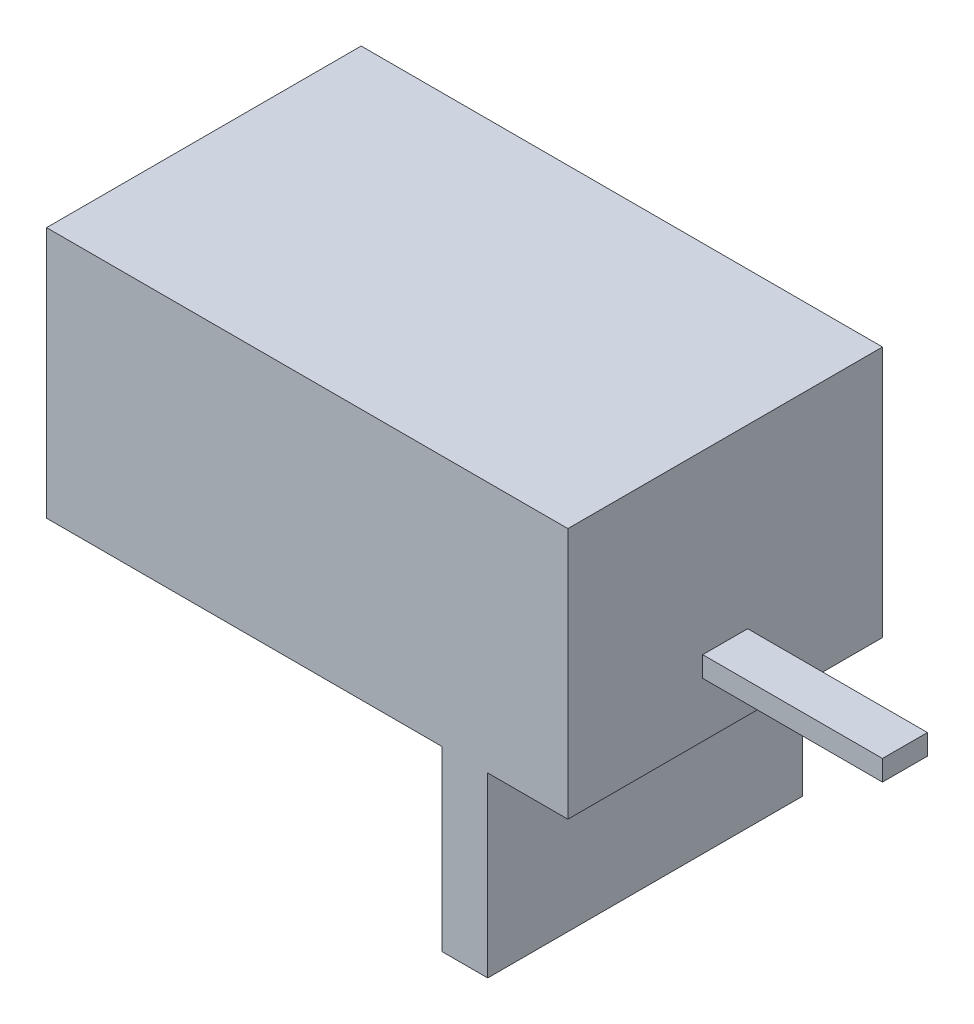
ISO-10303-21;
HEADER;
FILE_DESCRIPTION(('STEP AP214'),'2;1');
FILE_NAME('part.step','',(''),(''),'','','');
FILE_SCHEMA(('AUTOMOTIVE_DESIGN { 1 0 10303 214 1 1 1 1 }'));
ENDSEC;
DATA;
#1=APPLICATION_CONTEXT('core data for automotive mechanical design processes');
#2=APPLICATION_PROTOCOL_DEFINITION('international standard','automotive_design',2000,#1);
#3=PRODUCT_CONTEXT('',#1,'mechanical');
#4=PRODUCT('Part','Part','',(#3));
#5=PRODUCT_RELATED_PRODUCT_CATEGORY('part','',(#4));
#6=PRODUCT_DEFINITION_FORMATION('','',#4);
#7=PRODUCT_DEFINITION_CONTEXT('part definition',#1,'design');
#8=PRODUCT_DEFINITION('design','',#6,#7);
#9=PRODUCT_DEFINITION_SHAPE('','',#8);
#10=(LENGTH_UNIT() NAMED_UNIT(*) SI_UNIT(.MILLI.,.METRE.));
#11=(NAMED_UNIT(*) PLANE_ANGLE_UNIT() SI_UNIT($,.RADIAN.));
#12=(NAMED_UNIT(*) SI_UNIT($,.STERADIAN.) SOLID_ANGLE_UNIT());
#13=UNCERTAINTY_MEASURE_WITH_UNIT(LENGTH_MEASURE(1.E-05),#10,'distance_accuracy_value','');
#14=(GEOMETRIC_REPRESENTATION_CONTEXT(3) GLOBAL_UNCERTAINTY_ASSIGNED_CONTEXT((#13)) GLOBAL_UNIT_ASSIGNED_CONTEXT((#10,
#11,#12)) REPRESENTATION_CONTEXT('',''));
#15=CARTESIAN_POINT('',(0.,0.,0.));
#16=DIRECTION('',(0.,0.,1.));
#17=DIRECTION('',(1.,0.,0.));
#18=AXIS2_PLACEMENT_3D('',#15,#16,#17);
#19=CARTESIAN_POINT('',(0.,0.,0.));
#20=DIRECTION('',(0.,-1.,0.));
#21=DIRECTION('',(0.,0.,-1.));
#22=AXIS2_PLACEMENT_3D('',#19,#20,#21);
#23=PLANE('',#22);
#24=DIRECTION('',(1.,0.,0.));
#25=VECTOR('',#24,1.);
#26=CARTESIAN_POINT('',(-145.,0.,87.5));
#27=LINE('',#26,#25);
#28=CARTESIAN_POINT('',(100.4,0.,87.5));
#29=VERTEX_POINT('',#28);
#30=CARTESIAN_POINT('',(145.,0.,87.5));
#31=VERTEX_POINT('',#30);
#32=EDGE_CURVE('E205',#29,#31,#27,.T.);
#33=ORIENTED_EDGE('',*,*,#32,.F.);
#34=DIRECTION('',(0.,0.,-1.));
#35=VECTOR('',#34,1.);
#36=CARTESIAN_POINT('',(100.4,0.,87.5));
#37=LINE('',#36,#35);
#38=CARTESIAN_POINT('',(100.4,0.,-87.5));
#39=VERTEX_POINT('',#38);
#40=EDGE_CURVE('E165',#29,#39,#37,.T.);
#41=ORIENTED_EDGE('',*,*,#40,.T.);
#42=DIRECTION('',(-1.,0.,0.));
#43=VECTOR('',#42,1.);
#44=CARTESIAN_POINT('',(-145.,0.,-87.5));
#45=LINE('',#44,#43);
#46=CARTESIAN_POINT('',(145.,0.,-87.5));
#47=VERTEX_POINT('',#46);
#48=EDGE_CURVE('E200',#47,#39,#45,.T.);
#49=ORIENTED_EDGE('',*,*,#48,.F.);
#50=DIRECTION('',(0.,0.,-1.));
#51=VECTOR('',#50,1.);
#52=CARTESIAN_POINT('',(145.,0.,87.5));
#53=LINE('',#52,#51);
#54=EDGE_CURVE('E185',#31,#47,#53,.T.);
#55=ORIENTED_EDGE('',*,*,#54,.F.);
#56=EDGE_LOOP('',(#33,#41,#49,#55));
#57=FACE_BOUND('',#56,.T.);
#58=ADVANCED_FACE('F35',(#57),#23,.T.);
#59=CARTESIAN_POINT('',(145.,140.,87.5));
#60=DIRECTION('',(-1.,0.,0.));
#61=DIRECTION('',(0.,0.,1.));
#62=AXIS2_PLACEMENT_3D('',#59,#60,#61);
#63=PLANE('',#62);
#64=DIRECTION('',(0.,0.,-1.));
#65=VECTOR('',#64,1.);
#66=CARTESIAN_POINT('',(145.,41.7642757353534,0.));
#67=LINE('',#66,#65);
#68=CARTESIAN_POINT('',(145.,41.7642757353534,12.5));
#69=VERTEX_POINT('',#68);
#70=CARTESIAN_POINT('',(145.,41.7642757353534,-12.5));
#71=VERTEX_POINT('',#70);
#72=EDGE_CURVE('E50',#69,#71,#67,.T.);
#73=ORIENTED_EDGE('',*,*,#72,.T.);
#74=DIRECTION('',(0.,-1.,0.));
#75=VECTOR('',#74,1.);
#76=CARTESIAN_POINT('',(145.,0.,-12.5));
#77=LINE('',#76,#75);
#78=CARTESIAN_POINT('',(145.,30.3681582866702,-12.5));
#79=VERTEX_POINT('',#78);
#80=EDGE_CURVE('E128',#71,#79,#77,.T.);
#81=ORIENTED_EDGE('',*,*,#80,.T.);
#82=DIRECTION('',(0.,0.,-1.));
#83=VECTOR('',#82,1.);
#84=CARTESIAN_POINT('',(145.,30.3681582866702,0.));
#85=LINE('',#84,#83);
#86=CARTESIAN_POINT('',(145.,30.3681582866702,12.5));
#87=VERTEX_POINT('',#86);
#88=EDGE_CURVE('E141',#87,#79,#85,.T.);
#89=ORIENTED_EDGE('',*,*,#88,.F.);
#90=DIRECTION('',(0.,-1.,0.));
#91=VECTOR('',#90,1.);
#92=CARTESIAN_POINT('',(145.,0.,12.5));
#93=LINE('',#92,#91);
#94=EDGE_CURVE('E55',#69,#87,#93,.T.);
#95=ORIENTED_EDGE('',*,*,#94,.F.);
#96=EDGE_LOOP('',(#73,#81,#89,#95));
#97=FACE_BOUND('',#96,.T.);
#98=ORIENTED_EDGE('',*,*,#54,.T.);
#99=DIRECTION('',(0.,-1.,0.));
#100=VECTOR('',#99,1.);
#101=CARTESIAN_POINT('',(145.,140.,-87.5));
#102=LINE('',#101,#100);
#103=CARTESIAN_POINT('',(145.,140.,-87.5));
#104=VERTEX_POINT('',#103);
#105=EDGE_CURVE('E11',#104,#47,#102,.T.);
#106=ORIENTED_EDGE('',*,*,#105,.F.);
#107=DIRECTION('',(0.,0.,-1.));
#108=VECTOR('',#107,1.);
#109=CARTESIAN_POINT('',(145.,140.,87.5));
#110=LINE('',#109,#108);
#111=CARTESIAN_POINT('',(145.,140.,87.5));
#112=VERTEX_POINT('',#111);
#113=EDGE_CURVE('E186',#112,#104,#110,.T.);
#114=ORIENTED_EDGE('',*,*,#113,.F.);
#115=DIRECTION('',(0.,-1.,0.));
#116=VECTOR('',#115,1.);
#117=CARTESIAN_POINT('',(145.,140.,87.5));
#118=LINE('',#117,#116);
#119=EDGE_CURVE('E196',#112,#31,#118,.T.);
#120=ORIENTED_EDGE('',*,*,#119,.T.);
#121=EDGE_LOOP('',(#98,#106,#114,#120));
#122=FACE_BOUND('',#121,.T.);
#123=ADVANCED_FACE('F37',(#97,#122),#63,.F.);
#124=CARTESIAN_POINT('',(-145.,140.,-87.5));
#125=DIRECTION('',(0.,0.,1.));
#126=DIRECTION('',(1.,0.,0.));
#127=AXIS2_PLACEMENT_3D('',#124,#125,#126);
#128=PLANE('',#127);
#129=ORIENTED_EDGE('',*,*,#48,.T.);
#130=DIRECTION('',(0.,1.,0.));
#131=VECTOR('',#130,1.);
#132=CARTESIAN_POINT('',(100.4,-98.8,-87.5));
#133=LINE('',#132,#131);
#134=CARTESIAN_POINT('',(100.4,-98.8,-87.5));
#135=VERTEX_POINT('',#134);
#136=EDGE_CURVE('E181',#135,#39,#133,.T.);
#137=ORIENTED_EDGE('',*,*,#136,.F.);
#138=DIRECTION('',(1.,0.,0.));
#139=VECTOR('',#138,1.);
#140=CARTESIAN_POINT('',(75.,-98.8,-87.5));
#141=LINE('',#140,#139);
#142=CARTESIAN_POINT('',(75.,-98.8,-87.5));
#143=VERTEX_POINT('',#142);
#144=EDGE_CURVE('E164',#143,#135,#141,.T.);
#145=ORIENTED_EDGE('',*,*,#144,.F.);
#146=DIRECTION('',(0.,1.,0.));
#147=VECTOR('',#146,1.);
#148=CARTESIAN_POINT('',(75.,-98.8,-87.5));
#149=LINE('',#148,#147);
#150=CARTESIAN_POINT('',(75.,0.,-87.5));
#151=VERTEX_POINT('',#150);
#152=EDGE_CURVE('E183',#143,#151,#149,.T.);
#153=ORIENTED_EDGE('',*,*,#152,.T.);
#154=CARTESIAN_POINT('',(-145.,0.,-87.5));
#155=VERTEX_POINT('',#154);
#156=EDGE_CURVE('E199',#151,#155,#45,.T.);
#157=ORIENTED_EDGE('',*,*,#156,.T.);
#158=DIRECTION('',(0.,-1.,0.));
#159=VECTOR('',#158,1.);
#160=CARTESIAN_POINT('',(-145.,140.,-87.5));
#161=LINE('',#160,#159);
#162=CARTESIAN_POINT('',(-145.,140.,-87.5));
#163=VERTEX_POINT('',#162);
#164=EDGE_CURVE('E43',#163,#155,#161,.T.);
#165=ORIENTED_EDGE('',*,*,#164,.F.);
#166=DIRECTION('',(-1.,0.,0.));
#167=VECTOR('',#166,1.);
#168=CARTESIAN_POINT('',(-145.,140.,-87.5));
#169=LINE('',#168,#167);
#170=EDGE_CURVE('E189',#104,#163,#169,.T.);
#171=ORIENTED_EDGE('',*,*,#170,.F.);
#172=ORIENTED_EDGE('',*,*,#105,.T.);
#173=EDGE_LOOP('',(#129,#137,#145,#153,#157,#165,#171,#172));
#174=FACE_BOUND('',#173,.T.);
#175=ADVANCED_FACE('F234',(#174),#128,.F.);
#176=CARTESIAN_POINT('',(-145.,140.,87.5));
#177=DIRECTION('',(1.,0.,0.));
#178=DIRECTION('',(0.,0.,-1.));
#179=AXIS2_PLACEMENT_3D('',#176,#177,#178);
#180=PLANE('',#179);
#181=DIRECTION('',(0.,0.,1.));
#182=VECTOR('',#181,1.);
#183=CARTESIAN_POINT('',(-145.,0.,87.5));
#184=LINE('',#183,#182);
#185=CARTESIAN_POINT('',(-145.,0.,87.5));
#186=VERTEX_POINT('',#185);
#187=EDGE_CURVE('E203',#155,#186,#184,.T.);
#188=ORIENTED_EDGE('',*,*,#187,.T.);
#189=DIRECTION('',(0.,-1.,0.));
#190=VECTOR('',#189,1.);
#191=CARTESIAN_POINT('',(-145.,140.,87.5));
#192=LINE('',#191,#190);
#193=CARTESIAN_POINT('',(-145.,140.,87.5));
#194=VERTEX_POINT('',#193);
#195=EDGE_CURVE('E210',#194,#186,#192,.T.);
#196=ORIENTED_EDGE('',*,*,#195,.F.);
#197=DIRECTION('',(0.,0.,1.));
#198=VECTOR('',#197,1.);
#199=CARTESIAN_POINT('',(-145.,140.,87.5));
#200=LINE('',#199,#198);
#201=EDGE_CURVE('E192',#163,#194,#200,.T.);
#202=ORIENTED_EDGE('',*,*,#201,.F.);
#203=ORIENTED_EDGE('',*,*,#164,.T.);
#204=EDGE_LOOP('',(#188,#196,#202,#203));
#205=FACE_BOUND('',#204,.T.);
#206=ADVANCED_FACE('F217',(#205),#180,.F.);
#207=CARTESIAN_POINT('',(-145.,140.,87.5));
#208=DIRECTION('',(0.,0.,-1.));
#209=DIRECTION('',(-1.,0.,0.));
#210=AXIS2_PLACEMENT_3D('',#207,#208,#209);
#211=PLANE('',#210);
#212=CARTESIAN_POINT('',(75.,0.,87.5));
#213=VERTEX_POINT('',#212);
#214=EDGE_CURVE('E190',#186,#213,#27,.T.);
#215=ORIENTED_EDGE('',*,*,#214,.T.);
#216=DIRECTION('',(0.,1.,0.));
#217=VECTOR('',#216,1.);
#218=CARTESIAN_POINT('',(75.,-98.8,87.5));
#219=LINE('',#218,#217);
#220=CARTESIAN_POINT('',(75.,-98.8,87.5));
#221=VERTEX_POINT('',#220);
#222=EDGE_CURVE('E173',#221,#213,#219,.T.);
#223=ORIENTED_EDGE('',*,*,#222,.F.);
#224=DIRECTION('',(1.,0.,0.));
#225=VECTOR('',#224,1.);
#226=CARTESIAN_POINT('',(75.,-98.8,87.5));
#227=LINE('',#226,#225);
#228=CARTESIAN_POINT('',(100.4,-98.8,87.5));
#229=VERTEX_POINT('',#228);
#230=EDGE_CURVE('E170',#221,#229,#227,.T.);
#231=ORIENTED_EDGE('',*,*,#230,.T.);
#232=DIRECTION('',(0.,1.,0.));
#233=VECTOR('',#232,1.);
#234=CARTESIAN_POINT('',(100.4,-98.8,87.5));
#235=LINE('',#234,#233);
#236=EDGE_CURVE('E179',#229,#29,#235,.T.);
#237=ORIENTED_EDGE('',*,*,#236,.T.);
#238=ORIENTED_EDGE('',*,*,#32,.T.);
#239=ORIENTED_EDGE('',*,*,#119,.F.);
#240=DIRECTION('',(1.,0.,0.));
#241=VECTOR('',#240,1.);
#242=CARTESIAN_POINT('',(-145.,140.,87.5));
#243=LINE('',#242,#241);
#244=EDGE_CURVE('E194',#194,#112,#243,.T.);
#245=ORIENTED_EDGE('',*,*,#244,.F.);
#246=ORIENTED_EDGE('',*,*,#195,.T.);
#247=EDGE_LOOP('',(#215,#223,#231,#237,#238,#239,#245,#246));
#248=FACE_BOUND('',#247,.T.);
#249=ADVANCED_FACE('F226',(#248),#211,.F.);
#250=CARTESIAN_POINT('',(0.,140.,0.));
#251=DIRECTION('',(0.,-1.,0.));
#252=DIRECTION('',(0.,0.,-1.));
#253=AXIS2_PLACEMENT_3D('',#250,#251,#252);
#254=PLANE('',#253);
#255=ORIENTED_EDGE('',*,*,#113,.T.);
#256=ORIENTED_EDGE('',*,*,#170,.T.);
#257=ORIENTED_EDGE('',*,*,#201,.T.);
#258=ORIENTED_EDGE('',*,*,#244,.T.);
#259=EDGE_LOOP('',(#255,#256,#257,#258));
#260=FACE_BOUND('',#259,.T.);
#261=ADVANCED_FACE('F232',(#260),#254,.F.);
#262=DIRECTION('',(0.,0.,-1.));
#263=VECTOR('',#262,1.);
#264=CARTESIAN_POINT('',(75.,0.,87.5));
#265=LINE('',#264,#263);
#266=EDGE_CURVE('E131',#213,#151,#265,.T.);
#267=ORIENTED_EDGE('',*,*,#266,.F.);
#268=ORIENTED_EDGE('',*,*,#214,.F.);
#269=ORIENTED_EDGE('',*,*,#187,.F.);
#270=ORIENTED_EDGE('',*,*,#156,.F.);
#271=EDGE_LOOP('',(#267,#268,#269,#270));
#272=FACE_BOUND('',#271,.T.);
#273=ADVANCED_FACE('F224',(#272),#23,.T.);
#274=CARTESIAN_POINT('',(75.,-98.8,87.5));
#275=DIRECTION('',(1.,0.,0.));
#276=DIRECTION('',(0.,0.,-1.));
#277=AXIS2_PLACEMENT_3D('',#274,#275,#276);
#278=PLANE('',#277);
#279=ORIENTED_EDGE('',*,*,#266,.T.);
#280=ORIENTED_EDGE('',*,*,#152,.F.);
#281=DIRECTION('',(0.,0.,-1.));
#282=VECTOR('',#281,1.);
#283=CARTESIAN_POINT('',(75.,-98.8,87.5));
#284=LINE('',#283,#282);
#285=EDGE_CURVE('E161',#221,#143,#284,.T.);
#286=ORIENTED_EDGE('',*,*,#285,.F.);
#287=ORIENTED_EDGE('',*,*,#222,.T.);
#288=EDGE_LOOP('',(#279,#280,#286,#287));
#289=FACE_BOUND('',#288,.T.);
#290=ADVANCED_FACE('F249',(#289),#278,.F.);
#291=CARTESIAN_POINT('',(100.4,-98.8,87.5));
#292=DIRECTION('',(1.,0.,0.));
#293=DIRECTION('',(0.,0.,-1.));
#294=AXIS2_PLACEMENT_3D('',#291,#292,#293);
#295=PLANE('',#294);
#296=ORIENTED_EDGE('',*,*,#40,.F.);
#297=ORIENTED_EDGE('',*,*,#236,.F.);
#298=DIRECTION('',(0.,0.,-1.));
#299=VECTOR('',#298,1.);
#300=CARTESIAN_POINT('',(100.4,-98.8,87.5));
#301=LINE('',#300,#299);
#302=EDGE_CURVE('E167',#229,#135,#301,.T.);
#303=ORIENTED_EDGE('',*,*,#302,.T.);
#304=ORIENTED_EDGE('',*,*,#136,.T.);
#305=EDGE_LOOP('',(#296,#297,#303,#304));
#306=FACE_BOUND('',#305,.T.);
#307=ADVANCED_FACE('F242',(#306),#295,.T.);
#308=CARTESIAN_POINT('',(0.,-98.8,0.));
#309=DIRECTION('',(0.,-1.,0.));
#310=DIRECTION('',(0.,0.,-1.));
#311=AXIS2_PLACEMENT_3D('',#308,#309,#310);
#312=PLANE('',#311);
#313=ORIENTED_EDGE('',*,*,#285,.T.);
#314=ORIENTED_EDGE('',*,*,#144,.T.);
#315=ORIENTED_EDGE('',*,*,#302,.F.);
#316=ORIENTED_EDGE('',*,*,#230,.F.);
#317=EDGE_LOOP('',(#313,#314,#315,#316));
#318=FACE_BOUND('',#317,.T.);
#319=ADVANCED_FACE('F247',(#318),#312,.T.);
#320=CARTESIAN_POINT('',(245.,0.,-12.5));
#321=DIRECTION('',(0.,0.,-1.));
#322=DIRECTION('',(0.,1.,0.));
#323=AXIS2_PLACEMENT_3D('',#320,#321,#322);
#324=PLANE('',#323);
#325=ORIENTED_EDGE('',*,*,#80,.F.);
#326=DIRECTION('',(-1.,0.,0.));
#327=VECTOR('',#326,1.);
#328=CARTESIAN_POINT('',(245.,41.7642757353534,-12.5));
#329=LINE('',#328,#327);
#330=CARTESIAN_POINT('',(245.,41.7642757353534,-12.5));
#331=VERTEX_POINT('',#330);
#332=EDGE_CURVE('E123',#331,#71,#329,.T.);
#333=ORIENTED_EDGE('',*,*,#332,.F.);
#334=DIRECTION('',(0.,-1.,0.));
#335=VECTOR('',#334,1.);
#336=CARTESIAN_POINT('',(245.,0.,-12.5));
#337=LINE('',#336,#335);
#338=CARTESIAN_POINT('',(245.,30.3681582866702,-12.5));
#339=VERTEX_POINT('',#338);
#340=EDGE_CURVE('E127',#331,#339,#337,.T.);
#341=ORIENTED_EDGE('',*,*,#340,.T.);
#342=DIRECTION('',(-1.,0.,0.));
#343=VECTOR('',#342,1.);
#344=CARTESIAN_POINT('',(245.,30.3681582866702,-12.5));
#345=LINE('',#344,#343);
#346=EDGE_CURVE('E150',#339,#79,#345,.T.);
#347=ORIENTED_EDGE('',*,*,#346,.T.);
#348=EDGE_LOOP('',(#325,#333,#341,#347));
#349=FACE_BOUND('',#348,.T.);
#350=ADVANCED_FACE('F125',(#349),#324,.T.);
#351=CARTESIAN_POINT('',(245.,41.7642757353534,0.));
#352=DIRECTION('',(0.,1.,0.));
#353=DIRECTION('',(0.,0.,1.));
#354=AXIS2_PLACEMENT_3D('',#351,#352,#353);
#355=PLANE('',#354);
#356=ORIENTED_EDGE('',*,*,#72,.F.);
#357=DIRECTION('',(-1.,0.,0.));
#358=VECTOR('',#357,1.);
#359=CARTESIAN_POINT('',(245.,41.7642757353534,12.5));
#360=LINE('',#359,#358);
#361=CARTESIAN_POINT('',(245.,41.7642757353534,12.5));
#362=VERTEX_POINT('',#361);
#363=EDGE_CURVE('E132',#362,#69,#360,.T.);
#364=ORIENTED_EDGE('',*,*,#363,.F.);
#365=DIRECTION('',(0.,0.,-1.));
#366=VECTOR('',#365,1.);
#367=CARTESIAN_POINT('',(245.,41.7642757353534,0.));
#368=LINE('',#367,#366);
#369=EDGE_CURVE('E137',#362,#331,#368,.T.);
#370=ORIENTED_EDGE('',*,*,#369,.T.);
#371=ORIENTED_EDGE('',*,*,#332,.T.);
#372=EDGE_LOOP('',(#356,#364,#370,#371));
#373=FACE_BOUND('',#372,.T.);
#374=ADVANCED_FACE('F143',(#373),#355,.T.);
#375=CARTESIAN_POINT('',(245.,0.,12.5));
#376=DIRECTION('',(0.,0.,-1.));
#377=DIRECTION('',(0.,1.,0.));
#378=AXIS2_PLACEMENT_3D('',#375,#376,#377);
#379=PLANE('',#378);
#380=ORIENTED_EDGE('',*,*,#94,.T.);
#381=DIRECTION('',(-1.,0.,0.));
#382=VECTOR('',#381,1.);
#383=CARTESIAN_POINT('',(245.,30.3681582866702,12.5));
#384=LINE('',#383,#382);
#385=CARTESIAN_POINT('',(245.,30.3681582866702,12.5));
#386=VERTEX_POINT('',#385);
#387=EDGE_CURVE('E157',#386,#87,#384,.T.);
#388=ORIENTED_EDGE('',*,*,#387,.F.);
#389=DIRECTION('',(0.,-1.,0.));
#390=VECTOR('',#389,1.);
#391=CARTESIAN_POINT('',(245.,0.,12.5));
#392=LINE('',#391,#390);
#393=EDGE_CURVE('E145',#362,#386,#392,.T.);
#394=ORIENTED_EDGE('',*,*,#393,.F.);
#395=ORIENTED_EDGE('',*,*,#363,.T.);
#396=EDGE_LOOP('',(#380,#388,#394,#395));
#397=FACE_BOUND('',#396,.T.);
#398=ADVANCED_FACE('F331',(#397),#379,.F.);
#399=CARTESIAN_POINT('',(245.,30.3681582866702,0.));
#400=DIRECTION('',(0.,1.,0.));
#401=DIRECTION('',(0.,0.,1.));
#402=AXIS2_PLACEMENT_3D('',#399,#400,#401);
#403=PLANE('',#402);
#404=ORIENTED_EDGE('',*,*,#88,.T.);
#405=ORIENTED_EDGE('',*,*,#346,.F.);
#406=DIRECTION('',(0.,0.,-1.));
#407=VECTOR('',#406,1.);
#408=CARTESIAN_POINT('',(245.,30.3681582866702,0.));
#409=LINE('',#408,#407);
#410=EDGE_CURVE('E139',#386,#339,#409,.T.);
#411=ORIENTED_EDGE('',*,*,#410,.F.);
#412=ORIENTED_EDGE('',*,*,#387,.T.);
#413=EDGE_LOOP('',(#404,#405,#411,#412));
#414=FACE_BOUND('',#413,.T.);
#415=ADVANCED_FACE('F340',(#414),#403,.F.);
#416=CARTESIAN_POINT('',(245.,0.,0.));
#417=DIRECTION('',(1.,0.,0.));
#418=DIRECTION('',(0.,0.,-1.));
#419=AXIS2_PLACEMENT_3D('',#416,#417,#418);
#420=PLANE('',#419);
#421=ORIENTED_EDGE('',*,*,#340,.F.);
#422=ORIENTED_EDGE('',*,*,#369,.F.);
#423=ORIENTED_EDGE('',*,*,#393,.T.);
#424=ORIENTED_EDGE('',*,*,#410,.T.);
#425=EDGE_LOOP('',(#421,#422,#423,#424));
#426=FACE_BOUND('',#425,.T.);
#427=ADVANCED_FACE('F136',(#426),#420,.T.);
#428=CLOSED_SHELL('',(#58,#123,#175,#206,#249,#261,#273,#290,#307,#319,#350,#374,#398,#415,#427));
#429=MANIFOLD_SOLID_BREP('B2',#428);
#430=ADVANCED_BREP_SHAPE_REPRESENTATION('',(#18,#429),#14);
#431=SHAPE_DEFINITION_REPRESENTATION(#9,#430);
ENDSEC;
END-ISO-10303-21;
